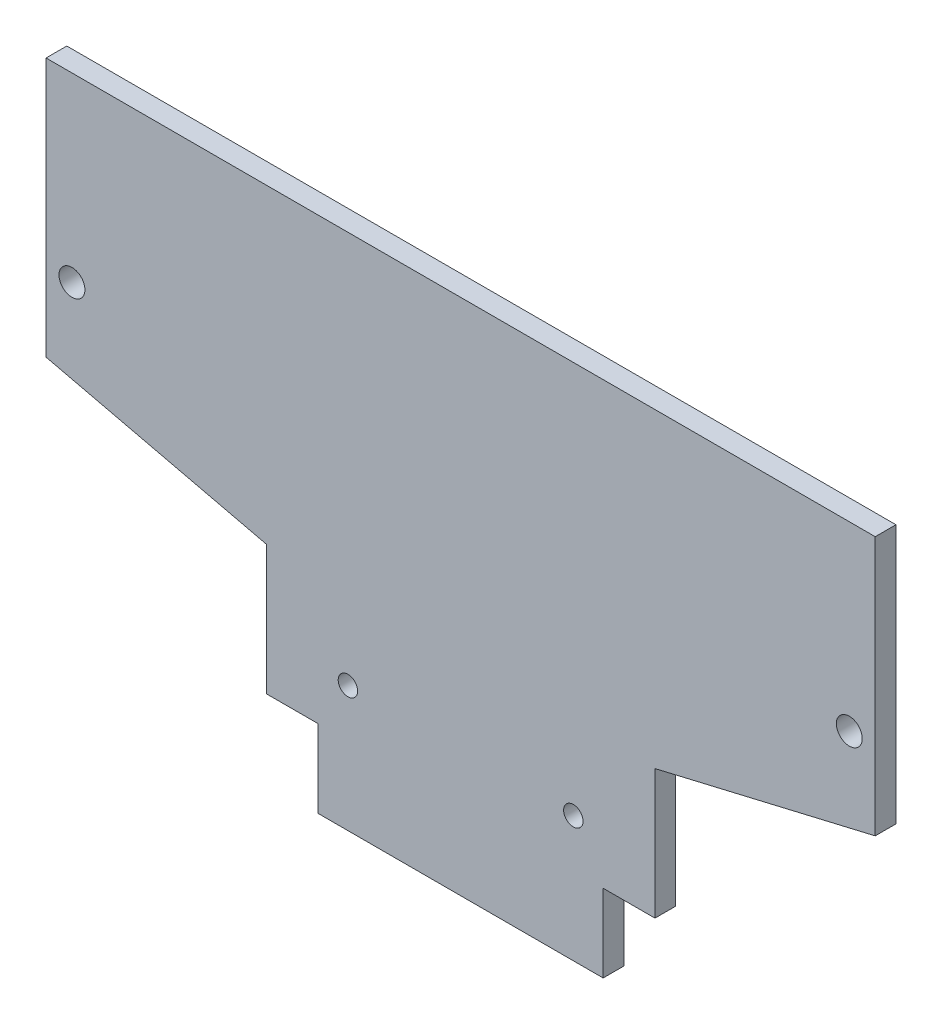
ISO-10303-21;
HEADER;
FILE_DESCRIPTION(('STEP AP214'),'2;1');
FILE_NAME('part.step','',(''),(''),'','','');
FILE_SCHEMA(('AUTOMOTIVE_DESIGN { 1 0 10303 214 1 1 1 1 }'));
ENDSEC;
DATA;
#1=APPLICATION_CONTEXT('core data for automotive mechanical design processes');
#2=APPLICATION_PROTOCOL_DEFINITION('international standard','automotive_design',2000,#1);
#3=PRODUCT_CONTEXT('',#1,'mechanical');
#4=PRODUCT('Part','Part','',(#3));
#5=PRODUCT_RELATED_PRODUCT_CATEGORY('part','',(#4));
#6=PRODUCT_DEFINITION_FORMATION('','',#4);
#7=PRODUCT_DEFINITION_CONTEXT('part definition',#1,'design');
#8=PRODUCT_DEFINITION('design','',#6,#7);
#9=PRODUCT_DEFINITION_SHAPE('','',#8);
#10=(LENGTH_UNIT() NAMED_UNIT(*) SI_UNIT(.MILLI.,.METRE.));
#11=(NAMED_UNIT(*) PLANE_ANGLE_UNIT() SI_UNIT($,.RADIAN.));
#12=(NAMED_UNIT(*) SI_UNIT($,.STERADIAN.) SOLID_ANGLE_UNIT());
#13=UNCERTAINTY_MEASURE_WITH_UNIT(LENGTH_MEASURE(1.E-05),#10,'distance_accuracy_value','');
#14=(GEOMETRIC_REPRESENTATION_CONTEXT(3) GLOBAL_UNCERTAINTY_ASSIGNED_CONTEXT((#13)) GLOBAL_UNIT_ASSIGNED_CONTEXT((#10,
#11,#12)) REPRESENTATION_CONTEXT('',''));
#15=CARTESIAN_POINT('',(0.,0.,0.));
#16=DIRECTION('',(0.,0.,1.));
#17=DIRECTION('',(1.,0.,0.));
#18=AXIS2_PLACEMENT_3D('',#15,#16,#17);
#19=CARTESIAN_POINT('',(0.,0.,1.6));
#20=DIRECTION('',(0.,0.,1.));
#21=DIRECTION('',(1.,0.,0.));
#22=AXIS2_PLACEMENT_3D('',#19,#20,#21);
#23=PLANE('',#22);
#24=CARTESIAN_POINT('',(-30.,26.,1.6));
#25=DIRECTION('',(0.,0.,1.));
#26=DIRECTION('',(1.,0.,0.));
#27=AXIS2_PLACEMENT_3D('',#24,#25,#26);
#28=CIRCLE('',#27,1.);
#29=CARTESIAN_POINT('',(-29.,26.,1.6));
#30=VERTEX_POINT('',#29);
#31=EDGE_CURVE('E134',#30,#30,#28,.T.);
#32=ORIENTED_EDGE('',*,*,#31,.F.);
#33=EDGE_LOOP('',(#32));
#34=FACE_BOUND('',#33,.T.);
#35=DIRECTION('',(1.,0.,0.));
#36=VECTOR('',#35,1.);
#37=CARTESIAN_POINT('',(-11.,0.,1.6));
#38=LINE('',#37,#36);
#39=CARTESIAN_POINT('',(-11.,0.,1.6));
#40=VERTEX_POINT('',#39);
#41=CARTESIAN_POINT('',(11.,0.,1.6));
#42=VERTEX_POINT('',#41);
#43=EDGE_CURVE('E125',#40,#42,#38,.T.);
#44=ORIENTED_EDGE('',*,*,#43,.T.);
#45=DIRECTION('',(0.,-1.,0.));
#46=VECTOR('',#45,1.);
#47=CARTESIAN_POINT('',(11.,6.,1.6));
#48=LINE('',#47,#46);
#49=CARTESIAN_POINT('',(11.,6.,1.6));
#50=VERTEX_POINT('',#49);
#51=EDGE_CURVE('E178',#50,#42,#48,.T.);
#52=ORIENTED_EDGE('',*,*,#51,.F.);
#53=DIRECTION('',(-1.,0.,0.));
#54=VECTOR('',#53,1.);
#55=CARTESIAN_POINT('',(15.,6.,1.6));
#56=LINE('',#55,#54);
#57=CARTESIAN_POINT('',(15.,6.,1.6));
#58=VERTEX_POINT('',#57);
#59=EDGE_CURVE('E239',#58,#50,#56,.T.);
#60=ORIENTED_EDGE('',*,*,#59,.F.);
#61=DIRECTION('',(0.,-1.,0.));
#62=VECTOR('',#61,1.);
#63=CARTESIAN_POINT('',(15.,16.,1.6));
#64=LINE('',#63,#62);
#65=CARTESIAN_POINT('',(15.,16.,1.6));
#66=VERTEX_POINT('',#65);
#67=EDGE_CURVE('E243',#66,#58,#64,.T.);
#68=ORIENTED_EDGE('',*,*,#67,.F.);
#69=DIRECTION('',(-0.973417168333576,-0.229039333725547,0.));
#70=VECTOR('',#69,1.);
#71=CARTESIAN_POINT('',(32.,20.,1.6));
#72=LINE('',#71,#70);
#73=CARTESIAN_POINT('',(32.,20.,1.6));
#74=VERTEX_POINT('',#73);
#75=EDGE_CURVE('E245',#74,#66,#72,.T.);
#76=ORIENTED_EDGE('',*,*,#75,.F.);
#77=DIRECTION('',(0.,-1.,0.));
#78=VECTOR('',#77,1.);
#79=CARTESIAN_POINT('',(32.,40.,1.6));
#80=LINE('',#79,#78);
#81=CARTESIAN_POINT('',(32.,40.,1.6));
#82=VERTEX_POINT('',#81);
#83=EDGE_CURVE('E251',#82,#74,#80,.T.);
#84=ORIENTED_EDGE('',*,*,#83,.F.);
#85=DIRECTION('',(-1.,0.,0.));
#86=VECTOR('',#85,1.);
#87=CARTESIAN_POINT('',(0.,40.,1.6));
#88=LINE('',#87,#86);
#89=CARTESIAN_POINT('',(-32.,40.,1.6));
#90=VERTEX_POINT('',#89);
#91=EDGE_CURVE('E94',#82,#90,#88,.T.);
#92=ORIENTED_EDGE('',*,*,#91,.T.);
#93=DIRECTION('',(0.,-1.,0.));
#94=VECTOR('',#93,1.);
#95=CARTESIAN_POINT('',(-32.,40.,1.6));
#96=LINE('',#95,#94);
#97=CARTESIAN_POINT('',(-32.,20.,1.6));
#98=VERTEX_POINT('',#97);
#99=EDGE_CURVE('E198',#90,#98,#96,.T.);
#100=ORIENTED_EDGE('',*,*,#99,.T.);
#101=DIRECTION('',(0.973417168333576,-0.229039333725547,0.));
#102=VECTOR('',#101,1.);
#103=CARTESIAN_POINT('',(-32.,20.,1.6));
#104=LINE('',#103,#102);
#105=CARTESIAN_POINT('',(-15.,16.,1.6));
#106=VERTEX_POINT('',#105);
#107=EDGE_CURVE('E111',#98,#106,#104,.T.);
#108=ORIENTED_EDGE('',*,*,#107,.T.);
#109=DIRECTION('',(0.,-1.,0.));
#110=VECTOR('',#109,1.);
#111=CARTESIAN_POINT('',(-15.,16.,1.6));
#112=LINE('',#111,#110);
#113=CARTESIAN_POINT('',(-15.,6.,1.6));
#114=VERTEX_POINT('',#113);
#115=EDGE_CURVE('E105',#106,#114,#112,.T.);
#116=ORIENTED_EDGE('',*,*,#115,.T.);
#117=DIRECTION('',(1.,0.,0.));
#118=VECTOR('',#117,1.);
#119=CARTESIAN_POINT('',(-15.,6.,1.6));
#120=LINE('',#119,#118);
#121=CARTESIAN_POINT('',(-11.,6.,1.6));
#122=VERTEX_POINT('',#121);
#123=EDGE_CURVE('E109',#114,#122,#120,.T.);
#124=ORIENTED_EDGE('',*,*,#123,.T.);
#125=DIRECTION('',(0.,-1.,0.));
#126=VECTOR('',#125,1.);
#127=CARTESIAN_POINT('',(-11.,6.,1.6));
#128=LINE('',#127,#126);
#129=EDGE_CURVE('E56',#122,#40,#128,.T.);
#130=ORIENTED_EDGE('',*,*,#129,.T.);
#131=EDGE_LOOP('',(#44,#52,#60,#68,#76,#84,#92,#100,#108,#116,#124,#130));
#132=FACE_BOUND('',#131,.T.);
#133=CARTESIAN_POINT('',(-8.7,9.7,1.6));
#134=DIRECTION('',(0.,0.,1.));
#135=DIRECTION('',(1.,0.,0.));
#136=AXIS2_PLACEMENT_3D('',#133,#134,#135);
#137=CIRCLE('',#136,0.75);
#138=CARTESIAN_POINT('',(-7.95,9.7,1.6));
#139=VERTEX_POINT('',#138);
#140=EDGE_CURVE('E183',#139,#139,#137,.T.);
#141=ORIENTED_EDGE('',*,*,#140,.F.);
#142=EDGE_LOOP('',(#141));
#143=FACE_BOUND('',#142,.T.);
#144=CARTESIAN_POINT('',(8.7,9.7,1.6));
#145=DIRECTION('',(0.,0.,-1.));
#146=DIRECTION('',(-1.,0.,0.));
#147=AXIS2_PLACEMENT_3D('',#144,#145,#146);
#148=CIRCLE('',#147,0.75);
#149=CARTESIAN_POINT('',(7.95,9.7,1.6));
#150=VERTEX_POINT('',#149);
#151=EDGE_CURVE('E436',#150,#150,#148,.T.);
#152=ORIENTED_EDGE('',*,*,#151,.T.);
#153=EDGE_LOOP('',(#152));
#154=FACE_BOUND('',#153,.T.);
#155=CARTESIAN_POINT('',(30.,26.,1.6));
#156=DIRECTION('',(0.,0.,-1.));
#157=DIRECTION('',(-1.,0.,0.));
#158=AXIS2_PLACEMENT_3D('',#155,#156,#157);
#159=CIRCLE('',#158,1.);
#160=CARTESIAN_POINT('',(29.,26.,1.6));
#161=VERTEX_POINT('',#160);
#162=EDGE_CURVE('E255',#161,#161,#159,.T.);
#163=ORIENTED_EDGE('',*,*,#162,.T.);
#164=EDGE_LOOP('',(#163));
#165=FACE_BOUND('',#164,.T.);
#166=ADVANCED_FACE('F39',(#34,#132,#143,#154,#165),#23,.T.);
#167=CARTESIAN_POINT('',(0.,0.,0.));
#168=DIRECTION('',(0.,0.,1.));
#169=DIRECTION('',(1.,0.,0.));
#170=AXIS2_PLACEMENT_3D('',#167,#168,#169);
#171=PLANE('',#170);
#172=DIRECTION('',(-1.,0.,0.));
#173=VECTOR('',#172,1.);
#174=CARTESIAN_POINT('',(0.,40.,0.));
#175=LINE('',#174,#173);
#176=CARTESIAN_POINT('',(32.,40.,0.));
#177=VERTEX_POINT('',#176);
#178=CARTESIAN_POINT('',(-32.,40.,0.));
#179=VERTEX_POINT('',#178);
#180=EDGE_CURVE('E131',#177,#179,#175,.T.);
#181=ORIENTED_EDGE('',*,*,#180,.F.);
#182=DIRECTION('',(0.,-1.,0.));
#183=VECTOR('',#182,1.);
#184=CARTESIAN_POINT('',(32.,40.,0.));
#185=LINE('',#184,#183);
#186=CARTESIAN_POINT('',(32.,20.,0.));
#187=VERTEX_POINT('',#186);
#188=EDGE_CURVE('E208',#177,#187,#185,.T.);
#189=ORIENTED_EDGE('',*,*,#188,.T.);
#190=DIRECTION('',(-0.973417168333576,-0.229039333725547,0.));
#191=VECTOR('',#190,1.);
#192=CARTESIAN_POINT('',(32.,20.,0.));
#193=LINE('',#192,#191);
#194=CARTESIAN_POINT('',(15.,16.,0.));
#195=VERTEX_POINT('',#194);
#196=EDGE_CURVE('E260',#187,#195,#193,.T.);
#197=ORIENTED_EDGE('',*,*,#196,.T.);
#198=DIRECTION('',(0.,-1.,0.));
#199=VECTOR('',#198,1.);
#200=CARTESIAN_POINT('',(15.,16.,0.));
#201=LINE('',#200,#199);
#202=CARTESIAN_POINT('',(15.,6.,0.));
#203=VERTEX_POINT('',#202);
#204=EDGE_CURVE('E257',#195,#203,#201,.T.);
#205=ORIENTED_EDGE('',*,*,#204,.T.);
#206=DIRECTION('',(-1.,0.,0.));
#207=VECTOR('',#206,1.);
#208=CARTESIAN_POINT('',(15.,6.,0.));
#209=LINE('',#208,#207);
#210=CARTESIAN_POINT('',(11.,6.,0.));
#211=VERTEX_POINT('',#210);
#212=EDGE_CURVE('E254',#203,#211,#209,.T.);
#213=ORIENTED_EDGE('',*,*,#212,.T.);
#214=DIRECTION('',(0.,-1.,0.));
#215=VECTOR('',#214,1.);
#216=CARTESIAN_POINT('',(11.,6.,0.));
#217=LINE('',#216,#215);
#218=CARTESIAN_POINT('',(11.,0.,0.));
#219=VERTEX_POINT('',#218);
#220=EDGE_CURVE('E163',#211,#219,#217,.T.);
#221=ORIENTED_EDGE('',*,*,#220,.T.);
#222=DIRECTION('',(1.,0.,0.));
#223=VECTOR('',#222,1.);
#224=CARTESIAN_POINT('',(-11.,0.,0.));
#225=LINE('',#224,#223);
#226=CARTESIAN_POINT('',(-11.,0.,0.));
#227=VERTEX_POINT('',#226);
#228=EDGE_CURVE('E141',#227,#219,#225,.T.);
#229=ORIENTED_EDGE('',*,*,#228,.F.);
#230=DIRECTION('',(0.,-1.,0.));
#231=VECTOR('',#230,1.);
#232=CARTESIAN_POINT('',(-11.,6.,0.));
#233=LINE('',#232,#231);
#234=CARTESIAN_POINT('',(-11.,6.,0.));
#235=VERTEX_POINT('',#234);
#236=EDGE_CURVE('E86',#235,#227,#233,.T.);
#237=ORIENTED_EDGE('',*,*,#236,.F.);
#238=DIRECTION('',(1.,0.,0.));
#239=VECTOR('',#238,1.);
#240=CARTESIAN_POINT('',(-15.,6.,0.));
#241=LINE('',#240,#239);
#242=CARTESIAN_POINT('',(-15.,6.,0.));
#243=VERTEX_POINT('',#242);
#244=EDGE_CURVE('E80',#243,#235,#241,.T.);
#245=ORIENTED_EDGE('',*,*,#244,.F.);
#246=DIRECTION('',(0.,-1.,0.));
#247=VECTOR('',#246,1.);
#248=CARTESIAN_POINT('',(-15.,16.,0.));
#249=LINE('',#248,#247);
#250=CARTESIAN_POINT('',(-15.,16.,0.));
#251=VERTEX_POINT('',#250);
#252=EDGE_CURVE('E119',#251,#243,#249,.T.);
#253=ORIENTED_EDGE('',*,*,#252,.F.);
#254=DIRECTION('',(0.973417168333576,-0.229039333725547,0.));
#255=VECTOR('',#254,1.);
#256=CARTESIAN_POINT('',(-32.,20.,0.));
#257=LINE('',#256,#255);
#258=CARTESIAN_POINT('',(-32.,20.,0.));
#259=VERTEX_POINT('',#258);
#260=EDGE_CURVE('E136',#259,#251,#257,.T.);
#261=ORIENTED_EDGE('',*,*,#260,.F.);
#262=DIRECTION('',(0.,-1.,0.));
#263=VECTOR('',#262,1.);
#264=CARTESIAN_POINT('',(-32.,40.,0.));
#265=LINE('',#264,#263);
#266=EDGE_CURVE('E133',#179,#259,#265,.T.);
#267=ORIENTED_EDGE('',*,*,#266,.F.);
#268=EDGE_LOOP('',(#181,#189,#197,#205,#213,#221,#229,#237,#245,#253,#261,#267));
#269=FACE_BOUND('',#268,.T.);
#270=CARTESIAN_POINT('',(-30.,26.,0.));
#271=DIRECTION('',(0.,0.,1.));
#272=DIRECTION('',(1.,0.,0.));
#273=AXIS2_PLACEMENT_3D('',#270,#271,#272);
#274=CIRCLE('',#273,1.);
#275=CARTESIAN_POINT('',(-29.,26.,0.));
#276=VERTEX_POINT('',#275);
#277=EDGE_CURVE('E191',#276,#276,#274,.T.);
#278=ORIENTED_EDGE('',*,*,#277,.T.);
#279=EDGE_LOOP('',(#278));
#280=FACE_BOUND('',#279,.T.);
#281=CARTESIAN_POINT('',(-8.7,9.7,0.));
#282=DIRECTION('',(0.,0.,1.));
#283=DIRECTION('',(1.,0.,0.));
#284=AXIS2_PLACEMENT_3D('',#281,#282,#283);
#285=CIRCLE('',#284,0.75);
#286=CARTESIAN_POINT('',(-7.95,9.7,0.));
#287=VERTEX_POINT('',#286);
#288=EDGE_CURVE('E179',#287,#287,#285,.T.);
#289=ORIENTED_EDGE('',*,*,#288,.T.);
#290=EDGE_LOOP('',(#289));
#291=FACE_BOUND('',#290,.T.);
#292=CARTESIAN_POINT('',(8.7,9.7,0.));
#293=DIRECTION('',(0.,0.,-1.));
#294=DIRECTION('',(-1.,0.,0.));
#295=AXIS2_PLACEMENT_3D('',#292,#293,#294);
#296=CIRCLE('',#295,0.75);
#297=CARTESIAN_POINT('',(7.95,9.7,0.));
#298=VERTEX_POINT('',#297);
#299=EDGE_CURVE('E439',#298,#298,#296,.T.);
#300=ORIENTED_EDGE('',*,*,#299,.F.);
#301=EDGE_LOOP('',(#300));
#302=FACE_BOUND('',#301,.T.);
#303=CARTESIAN_POINT('',(30.,26.,0.));
#304=DIRECTION('',(0.,0.,-1.));
#305=DIRECTION('',(-1.,0.,0.));
#306=AXIS2_PLACEMENT_3D('',#303,#304,#305);
#307=CIRCLE('',#306,1.);
#308=CARTESIAN_POINT('',(29.,26.,0.));
#309=VERTEX_POINT('',#308);
#310=EDGE_CURVE('E442',#309,#309,#307,.T.);
#311=ORIENTED_EDGE('',*,*,#310,.F.);
#312=EDGE_LOOP('',(#311));
#313=FACE_BOUND('',#312,.T.);
#314=ADVANCED_FACE('F156',(#269,#280,#291,#302,#313),#171,.F.);
#315=CARTESIAN_POINT('',(0.,40.,1.6));
#316=DIRECTION('',(0.,-1.,0.));
#317=DIRECTION('',(1.,0.,0.));
#318=AXIS2_PLACEMENT_3D('',#315,#316,#317);
#319=PLANE('',#318);
#320=ORIENTED_EDGE('',*,*,#180,.T.);
#321=DIRECTION('',(0.,0.,-1.));
#322=VECTOR('',#321,1.);
#323=CARTESIAN_POINT('',(-32.,40.,1.6));
#324=LINE('',#323,#322);
#325=EDGE_CURVE('E11',#90,#179,#324,.T.);
#326=ORIENTED_EDGE('',*,*,#325,.F.);
#327=ORIENTED_EDGE('',*,*,#91,.F.);
#328=DIRECTION('',(0.,0.,-1.));
#329=VECTOR('',#328,1.);
#330=CARTESIAN_POINT('',(32.,40.,1.6));
#331=LINE('',#330,#329);
#332=EDGE_CURVE('E203',#82,#177,#331,.T.);
#333=ORIENTED_EDGE('',*,*,#332,.T.);
#334=EDGE_LOOP('',(#320,#326,#327,#333));
#335=FACE_BOUND('',#334,.T.);
#336=ADVANCED_FACE('F41',(#335),#319,.F.);
#337=CARTESIAN_POINT('',(-32.,40.,1.6));
#338=DIRECTION('',(1.,0.,0.));
#339=DIRECTION('',(0.,0.,-1.));
#340=AXIS2_PLACEMENT_3D('',#337,#338,#339);
#341=PLANE('',#340);
#342=ORIENTED_EDGE('',*,*,#266,.T.);
#343=DIRECTION('',(0.,0.,-1.));
#344=VECTOR('',#343,1.);
#345=CARTESIAN_POINT('',(-32.,20.,1.6));
#346=LINE('',#345,#344);
#347=EDGE_CURVE('E48',#98,#259,#346,.T.);
#348=ORIENTED_EDGE('',*,*,#347,.F.);
#349=ORIENTED_EDGE('',*,*,#99,.F.);
#350=ORIENTED_EDGE('',*,*,#325,.T.);
#351=EDGE_LOOP('',(#342,#348,#349,#350));
#352=FACE_BOUND('',#351,.T.);
#353=ADVANCED_FACE('F199',(#352),#341,.F.);
#354=CARTESIAN_POINT('',(-32.,20.,1.6));
#355=DIRECTION('',(0.229039333725547,0.973417168333576,0.));
#356=DIRECTION('',(-0.973417168333576,0.229039333725547,0.));
#357=AXIS2_PLACEMENT_3D('',#354,#355,#356);
#358=PLANE('',#357);
#359=ORIENTED_EDGE('',*,*,#260,.T.);
#360=DIRECTION('',(0.,0.,-1.));
#361=VECTOR('',#360,1.);
#362=CARTESIAN_POINT('',(-15.,16.,1.6));
#363=LINE('',#362,#361);
#364=EDGE_CURVE('E120',#106,#251,#363,.T.);
#365=ORIENTED_EDGE('',*,*,#364,.F.);
#366=ORIENTED_EDGE('',*,*,#107,.F.);
#367=ORIENTED_EDGE('',*,*,#347,.T.);
#368=EDGE_LOOP('',(#359,#365,#366,#367));
#369=FACE_BOUND('',#368,.T.);
#370=ADVANCED_FACE('F150',(#369),#358,.F.);
#371=CARTESIAN_POINT('',(-15.,16.,1.6));
#372=DIRECTION('',(1.,0.,0.));
#373=DIRECTION('',(0.,1.,0.));
#374=AXIS2_PLACEMENT_3D('',#371,#372,#373);
#375=PLANE('',#374);
#376=ORIENTED_EDGE('',*,*,#252,.T.);
#377=DIRECTION('',(0.,0.,-1.));
#378=VECTOR('',#377,1.);
#379=CARTESIAN_POINT('',(-15.,6.,1.6));
#380=LINE('',#379,#378);
#381=EDGE_CURVE('E116',#114,#243,#380,.T.);
#382=ORIENTED_EDGE('',*,*,#381,.F.);
#383=ORIENTED_EDGE('',*,*,#115,.F.);
#384=ORIENTED_EDGE('',*,*,#364,.T.);
#385=EDGE_LOOP('',(#376,#382,#383,#384));
#386=FACE_BOUND('',#385,.T.);
#387=ADVANCED_FACE('F117',(#386),#375,.F.);
#388=CARTESIAN_POINT('',(-15.,6.,1.6));
#389=DIRECTION('',(0.,1.,0.));
#390=DIRECTION('',(-1.,0.,0.));
#391=AXIS2_PLACEMENT_3D('',#388,#389,#390);
#392=PLANE('',#391);
#393=ORIENTED_EDGE('',*,*,#244,.T.);
#394=DIRECTION('',(0.,0.,-1.));
#395=VECTOR('',#394,1.);
#396=CARTESIAN_POINT('',(-11.,6.,1.6));
#397=LINE('',#396,#395);
#398=EDGE_CURVE('E121',#122,#235,#397,.T.);
#399=ORIENTED_EDGE('',*,*,#398,.F.);
#400=ORIENTED_EDGE('',*,*,#123,.F.);
#401=ORIENTED_EDGE('',*,*,#381,.T.);
#402=EDGE_LOOP('',(#393,#399,#400,#401));
#403=FACE_BOUND('',#402,.T.);
#404=ADVANCED_FACE('F123',(#403),#392,.F.);
#405=CARTESIAN_POINT('',(-11.,6.,1.6));
#406=DIRECTION('',(1.,0.,0.));
#407=DIRECTION('',(0.,1.,0.));
#408=AXIS2_PLACEMENT_3D('',#405,#406,#407);
#409=PLANE('',#408);
#410=ORIENTED_EDGE('',*,*,#236,.T.);
#411=DIRECTION('',(0.,0.,-1.));
#412=VECTOR('',#411,1.);
#413=CARTESIAN_POINT('',(-11.,0.,1.6));
#414=LINE('',#413,#412);
#415=EDGE_CURVE('E130',#40,#227,#414,.T.);
#416=ORIENTED_EDGE('',*,*,#415,.F.);
#417=ORIENTED_EDGE('',*,*,#129,.F.);
#418=ORIENTED_EDGE('',*,*,#398,.T.);
#419=EDGE_LOOP('',(#410,#416,#417,#418));
#420=FACE_BOUND('',#419,.T.);
#421=ADVANCED_FACE('F298',(#420),#409,.F.);
#422=CARTESIAN_POINT('',(-11.,0.,1.6));
#423=DIRECTION('',(0.,1.,0.));
#424=DIRECTION('',(0.,0.,1.));
#425=AXIS2_PLACEMENT_3D('',#422,#423,#424);
#426=PLANE('',#425);
#427=ORIENTED_EDGE('',*,*,#228,.T.);
#428=DIRECTION('',(0.,0.,-1.));
#429=VECTOR('',#428,1.);
#430=CARTESIAN_POINT('',(11.,0.,1.6));
#431=LINE('',#430,#429);
#432=EDGE_CURVE('E170',#42,#219,#431,.T.);
#433=ORIENTED_EDGE('',*,*,#432,.F.);
#434=ORIENTED_EDGE('',*,*,#43,.F.);
#435=ORIENTED_EDGE('',*,*,#415,.T.);
#436=EDGE_LOOP('',(#427,#433,#434,#435));
#437=FACE_BOUND('',#436,.T.);
#438=ADVANCED_FACE('F167',(#437),#426,.F.);
#439=CARTESIAN_POINT('',(-30.,26.,1.6));
#440=DIRECTION('',(0.,0.,-1.));
#441=DIRECTION('',(-1.,0.,0.));
#442=AXIS2_PLACEMENT_3D('',#439,#440,#441);
#443=CYLINDRICAL_SURFACE('',#442,1.);
#444=ORIENTED_EDGE('',*,*,#31,.T.);
#445=EDGE_LOOP('',(#444));
#446=FACE_BOUND('',#445,.T.);
#447=ORIENTED_EDGE('',*,*,#277,.F.);
#448=EDGE_LOOP('',(#447));
#449=FACE_BOUND('',#448,.T.);
#450=ADVANCED_FACE('F293',(#446,#449),#443,.F.);
#451=CARTESIAN_POINT('',(-8.7,9.7,1.6));
#452=DIRECTION('',(0.,0.,-1.));
#453=DIRECTION('',(-1.,0.,0.));
#454=AXIS2_PLACEMENT_3D('',#451,#452,#453);
#455=CYLINDRICAL_SURFACE('',#454,0.75);
#456=ORIENTED_EDGE('',*,*,#140,.T.);
#457=EDGE_LOOP('',(#456));
#458=FACE_BOUND('',#457,.T.);
#459=ORIENTED_EDGE('',*,*,#288,.F.);
#460=EDGE_LOOP('',(#459));
#461=FACE_BOUND('',#460,.T.);
#462=ADVANCED_FACE('F329',(#458,#461),#455,.F.);
#463=CARTESIAN_POINT('',(11.,6.,1.6));
#464=DIRECTION('',(1.,0.,0.));
#465=DIRECTION('',(0.,1.,0.));
#466=AXIS2_PLACEMENT_3D('',#463,#464,#465);
#467=PLANE('',#466);
#468=ORIENTED_EDGE('',*,*,#220,.F.);
#469=DIRECTION('',(0.,0.,-1.));
#470=VECTOR('',#469,1.);
#471=CARTESIAN_POINT('',(11.,6.,1.6));
#472=LINE('',#471,#470);
#473=EDGE_CURVE('E180',#50,#211,#472,.T.);
#474=ORIENTED_EDGE('',*,*,#473,.F.);
#475=ORIENTED_EDGE('',*,*,#51,.T.);
#476=ORIENTED_EDGE('',*,*,#432,.T.);
#477=EDGE_LOOP('',(#468,#474,#475,#476));
#478=FACE_BOUND('',#477,.T.);
#479=ADVANCED_FACE('F175',(#478),#467,.T.);
#480=CARTESIAN_POINT('',(15.,6.,1.6));
#481=DIRECTION('',(0.,-1.,0.));
#482=DIRECTION('',(1.,0.,0.));
#483=AXIS2_PLACEMENT_3D('',#480,#481,#482);
#484=PLANE('',#483);
#485=ORIENTED_EDGE('',*,*,#212,.F.);
#486=DIRECTION('',(0.,0.,-1.));
#487=VECTOR('',#486,1.);
#488=CARTESIAN_POINT('',(15.,6.,1.6));
#489=LINE('',#488,#487);
#490=EDGE_CURVE('E186',#58,#203,#489,.T.);
#491=ORIENTED_EDGE('',*,*,#490,.F.);
#492=ORIENTED_EDGE('',*,*,#59,.T.);
#493=ORIENTED_EDGE('',*,*,#473,.T.);
#494=EDGE_LOOP('',(#485,#491,#492,#493));
#495=FACE_BOUND('',#494,.T.);
#496=ADVANCED_FACE('F242',(#495),#484,.T.);
#497=CARTESIAN_POINT('',(15.,16.,1.6));
#498=DIRECTION('',(1.,0.,0.));
#499=DIRECTION('',(0.,1.,0.));
#500=AXIS2_PLACEMENT_3D('',#497,#498,#499);
#501=PLANE('',#500);
#502=ORIENTED_EDGE('',*,*,#204,.F.);
#503=DIRECTION('',(0.,0.,-1.));
#504=VECTOR('',#503,1.);
#505=CARTESIAN_POINT('',(15.,16.,1.6));
#506=LINE('',#505,#504);
#507=EDGE_CURVE('E265',#66,#195,#506,.T.);
#508=ORIENTED_EDGE('',*,*,#507,.F.);
#509=ORIENTED_EDGE('',*,*,#67,.T.);
#510=ORIENTED_EDGE('',*,*,#490,.T.);
#511=EDGE_LOOP('',(#502,#508,#509,#510));
#512=FACE_BOUND('',#511,.T.);
#513=ADVANCED_FACE('F268',(#512),#501,.T.);
#514=CARTESIAN_POINT('',(32.,20.,1.6));
#515=DIRECTION('',(0.229039333725547,-0.973417168333576,0.));
#516=DIRECTION('',(0.973417168333576,0.229039333725547,0.));
#517=AXIS2_PLACEMENT_3D('',#514,#515,#516);
#518=PLANE('',#517);
#519=ORIENTED_EDGE('',*,*,#196,.F.);
#520=DIRECTION('',(0.,0.,-1.));
#521=VECTOR('',#520,1.);
#522=CARTESIAN_POINT('',(32.,20.,1.6));
#523=LINE('',#522,#521);
#524=EDGE_CURVE('E216',#74,#187,#523,.T.);
#525=ORIENTED_EDGE('',*,*,#524,.F.);
#526=ORIENTED_EDGE('',*,*,#75,.T.);
#527=ORIENTED_EDGE('',*,*,#507,.T.);
#528=EDGE_LOOP('',(#519,#525,#526,#527));
#529=FACE_BOUND('',#528,.T.);
#530=ADVANCED_FACE('F270',(#529),#518,.T.);
#531=CARTESIAN_POINT('',(32.,40.,1.6));
#532=DIRECTION('',(1.,0.,0.));
#533=DIRECTION('',(0.,0.,-1.));
#534=AXIS2_PLACEMENT_3D('',#531,#532,#533);
#535=PLANE('',#534);
#536=ORIENTED_EDGE('',*,*,#188,.F.);
#537=ORIENTED_EDGE('',*,*,#332,.F.);
#538=ORIENTED_EDGE('',*,*,#83,.T.);
#539=ORIENTED_EDGE('',*,*,#524,.T.);
#540=EDGE_LOOP('',(#536,#537,#538,#539));
#541=FACE_BOUND('',#540,.T.);
#542=ADVANCED_FACE('F272',(#541),#535,.T.);
#543=CARTESIAN_POINT('',(30.,26.,1.6));
#544=DIRECTION('',(0.,0.,-1.));
#545=DIRECTION('',(-1.,0.,0.));
#546=AXIS2_PLACEMENT_3D('',#543,#544,#545);
#547=CYLINDRICAL_SURFACE('',#546,1.);
#548=ORIENTED_EDGE('',*,*,#162,.F.);
#549=EDGE_LOOP('',(#548));
#550=FACE_BOUND('',#549,.T.);
#551=ORIENTED_EDGE('',*,*,#310,.T.);
#552=EDGE_LOOP('',(#551));
#553=FACE_BOUND('',#552,.T.);
#554=ADVANCED_FACE('F274',(#550,#553),#547,.F.);
#555=CARTESIAN_POINT('',(8.7,9.7,1.6));
#556=DIRECTION('',(0.,0.,-1.));
#557=DIRECTION('',(-1.,0.,0.));
#558=AXIS2_PLACEMENT_3D('',#555,#556,#557);
#559=CYLINDRICAL_SURFACE('',#558,0.75);
#560=ORIENTED_EDGE('',*,*,#151,.F.);
#561=EDGE_LOOP('',(#560));
#562=FACE_BOUND('',#561,.T.);
#563=ORIENTED_EDGE('',*,*,#299,.T.);
#564=EDGE_LOOP('',(#563));
#565=FACE_BOUND('',#564,.T.);
#566=ADVANCED_FACE('F280',(#562,#565),#559,.F.);
#567=CLOSED_SHELL('',(#166,#314,#336,#353,#370,#387,#404,#421,#438,#450,#462,#479,#496,#513,
#530,#542,#554,#566));
#568=MANIFOLD_SOLID_BREP('B2',#567);
#569=ADVANCED_BREP_SHAPE_REPRESENTATION('',(#18,#568),#14);
#570=SHAPE_DEFINITION_REPRESENTATION(#9,#569);
ENDSEC;
END-ISO-10303-21;
